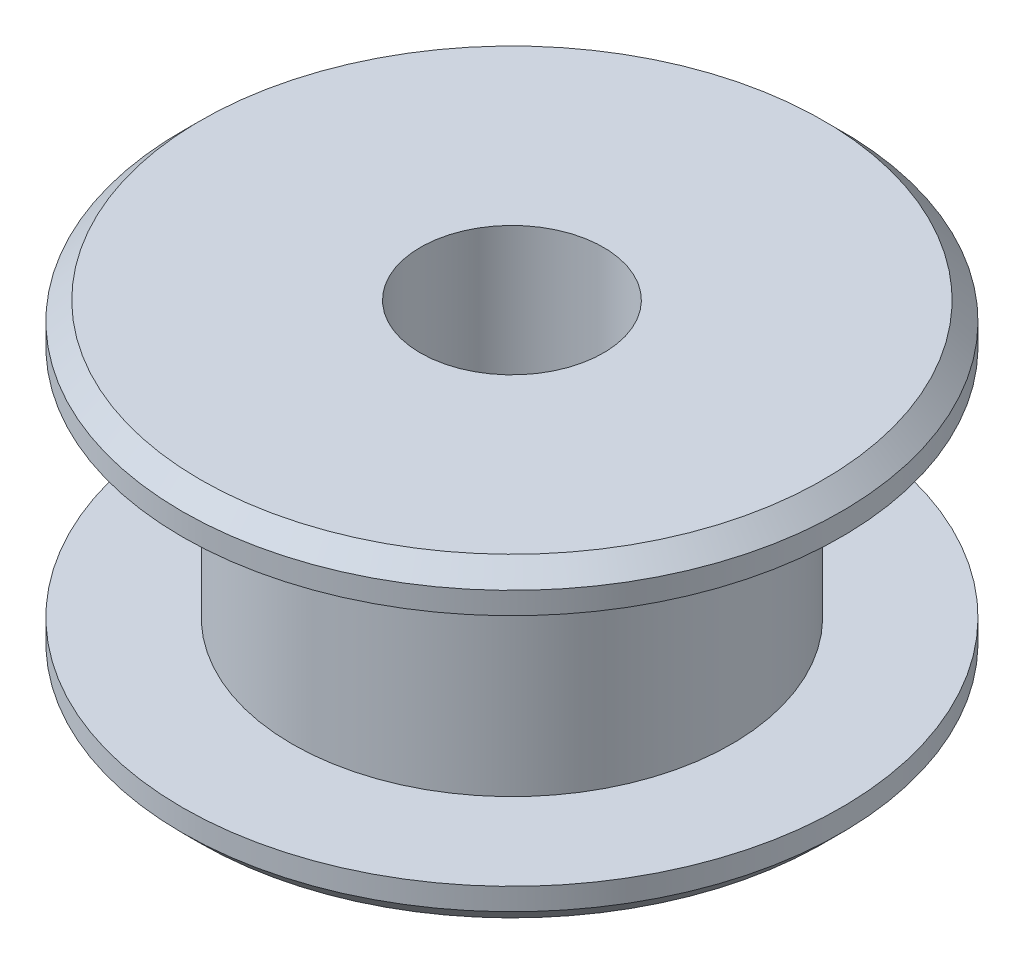
ISO-10303-21;
HEADER;
FILE_DESCRIPTION(('STEP AP214'),'2;1');
FILE_NAME('part.step','',(''),(''),'','','');
FILE_SCHEMA(('AUTOMOTIVE_DESIGN { 1 0 10303 214 1 1 1 1 }'));
ENDSEC;
DATA;
#1=APPLICATION_CONTEXT('core data for automotive mechanical design processes');
#2=APPLICATION_PROTOCOL_DEFINITION('international standard','automotive_design',2000,#1);
#3=PRODUCT_CONTEXT('',#1,'mechanical');
#4=PRODUCT('Part','Part','',(#3));
#5=PRODUCT_RELATED_PRODUCT_CATEGORY('part','',(#4));
#6=PRODUCT_DEFINITION_FORMATION('','',#4);
#7=PRODUCT_DEFINITION_CONTEXT('part definition',#1,'design');
#8=PRODUCT_DEFINITION('design','',#6,#7);
#9=PRODUCT_DEFINITION_SHAPE('','',#8);
#10=(LENGTH_UNIT() NAMED_UNIT(*) SI_UNIT(.MILLI.,.METRE.));
#11=(NAMED_UNIT(*) PLANE_ANGLE_UNIT() SI_UNIT($,.RADIAN.));
#12=(NAMED_UNIT(*) SI_UNIT($,.STERADIAN.) SOLID_ANGLE_UNIT());
#13=UNCERTAINTY_MEASURE_WITH_UNIT(LENGTH_MEASURE(1.E-05),#10,'distance_accuracy_value','');
#14=(GEOMETRIC_REPRESENTATION_CONTEXT(3) GLOBAL_UNCERTAINTY_ASSIGNED_CONTEXT((#13)) GLOBAL_UNIT_ASSIGNED_CONTEXT((#10,
#11,#12)) REPRESENTATION_CONTEXT('',''));
#15=CARTESIAN_POINT('',(0.,0.,0.));
#16=DIRECTION('',(0.,0.,1.));
#17=DIRECTION('',(1.,0.,0.));
#18=AXIS2_PLACEMENT_3D('',#15,#16,#17);
#19=CARTESIAN_POINT('',(0.,1.1,0.));
#20=DIRECTION('',(0.,-1.,0.));
#21=DIRECTION('',(0.,0.,-1.));
#22=AXIS2_PLACEMENT_3D('',#19,#20,#21);
#23=CYLINDRICAL_SURFACE('',#22,9.);
#24=CARTESIAN_POINT('',(0.,0.500000000000004,0.));
#25=DIRECTION('',(0.,1.,0.));
#26=DIRECTION('',(0.,0.,1.));
#27=AXIS2_PLACEMENT_3D('',#24,#25,#26);
#28=CIRCLE('',#27,9.);
#29=CARTESIAN_POINT('',(0.,0.500000000000004,9.));
#30=VERTEX_POINT('',#29);
#31=EDGE_CURVE('E49',#30,#30,#28,.T.);
#32=ORIENTED_EDGE('',*,*,#31,.T.);
#33=EDGE_LOOP('',(#32));
#34=FACE_BOUND('',#33,.T.);
#35=CARTESIAN_POINT('',(0.,1.1,0.));
#36=DIRECTION('',(0.,1.,0.));
#37=DIRECTION('',(0.,0.,1.));
#38=AXIS2_PLACEMENT_3D('',#35,#36,#37);
#39=CIRCLE('',#38,9.);
#40=CARTESIAN_POINT('',(0.,1.1,9.));
#41=VERTEX_POINT('',#40);
#42=EDGE_CURVE('E54',#41,#41,#39,.T.);
#43=ORIENTED_EDGE('',*,*,#42,.F.);
#44=EDGE_LOOP('',(#43));
#45=FACE_BOUND('',#44,.T.);
#46=ADVANCED_FACE('F34',(#34,#45),#23,.T.);
#47=CARTESIAN_POINT('',(0.,1.1,0.));
#48=DIRECTION('',(0.,1.,0.));
#49=DIRECTION('',(0.,0.,1.));
#50=AXIS2_PLACEMENT_3D('',#47,#48,#49);
#51=PLANE('',#50);
#52=CARTESIAN_POINT('',(0.,1.1,0.));
#53=DIRECTION('',(0.,1.,0.));
#54=DIRECTION('',(0.,0.,1.));
#55=AXIS2_PLACEMENT_3D('',#52,#53,#54);
#56=CIRCLE('',#55,6.);
#57=CARTESIAN_POINT('',(0.,1.1,6.));
#58=VERTEX_POINT('',#57);
#59=EDGE_CURVE('E58',#58,#58,#56,.T.);
#60=ORIENTED_EDGE('',*,*,#59,.F.);
#61=EDGE_LOOP('',(#60));
#62=FACE_BOUND('',#61,.T.);
#63=ORIENTED_EDGE('',*,*,#42,.T.);
#64=EDGE_LOOP('',(#63));
#65=FACE_BOUND('',#64,.T.);
#66=ADVANCED_FACE('F97',(#62,#65),#51,.T.);
#67=CARTESIAN_POINT('',(0.,0.,0.));
#68=DIRECTION('',(0.,1.,0.));
#69=DIRECTION('',(0.,0.,1.));
#70=AXIS2_PLACEMENT_3D('',#67,#68,#69);
#71=PLANE('',#70);
#72=CARTESIAN_POINT('',(0.,0.,0.));
#73=DIRECTION('',(0.,1.,0.));
#74=DIRECTION('',(0.,0.,1.));
#75=AXIS2_PLACEMENT_3D('',#72,#73,#74);
#76=CIRCLE('',#75,2.5);
#77=CARTESIAN_POINT('',(0.,0.,2.5));
#78=VERTEX_POINT('',#77);
#79=EDGE_CURVE('E66',#78,#78,#76,.T.);
#80=ORIENTED_EDGE('',*,*,#79,.T.);
#81=EDGE_LOOP('',(#80));
#82=FACE_BOUND('',#81,.T.);
#83=CARTESIAN_POINT('',(0.,0.,0.));
#84=DIRECTION('',(0.,1.,0.));
#85=DIRECTION('',(0.,0.,1.));
#86=AXIS2_PLACEMENT_3D('',#83,#84,#85);
#87=CIRCLE('',#86,8.49999999999999);
#88=CARTESIAN_POINT('',(0.,0.,8.49999999999999));
#89=VERTEX_POINT('',#88);
#90=EDGE_CURVE('E45',#89,#89,#87,.F.);
#91=ORIENTED_EDGE('',*,*,#90,.T.);
#92=EDGE_LOOP('',(#91));
#93=FACE_BOUND('',#92,.T.);
#94=ADVANCED_FACE('F73',(#82,#93),#71,.F.);
#95=CARTESIAN_POINT('',(0.,7.5,0.));
#96=DIRECTION('',(0.,-1.,0.));
#97=DIRECTION('',(0.,0.,-1.));
#98=AXIS2_PLACEMENT_3D('',#95,#96,#97);
#99=CYLINDRICAL_SURFACE('',#98,6.);
#100=CARTESIAN_POINT('',(0.,7.5,0.));
#101=DIRECTION('',(0.,1.,0.));
#102=DIRECTION('',(0.,0.,1.));
#103=AXIS2_PLACEMENT_3D('',#100,#101,#102);
#104=CIRCLE('',#103,6.);
#105=CARTESIAN_POINT('',(0.,7.5,6.));
#106=VERTEX_POINT('',#105);
#107=EDGE_CURVE('E57',#106,#106,#104,.T.);
#108=ORIENTED_EDGE('',*,*,#107,.F.);
#109=EDGE_LOOP('',(#108));
#110=FACE_BOUND('',#109,.T.);
#111=ORIENTED_EDGE('',*,*,#59,.T.);
#112=EDGE_LOOP('',(#111));
#113=FACE_BOUND('',#112,.T.);
#114=ADVANCED_FACE('F94',(#110,#113),#99,.T.);
#115=CARTESIAN_POINT('',(0.,8.6,0.));
#116=DIRECTION('',(0.,-1.,0.));
#117=DIRECTION('',(0.,0.,-1.));
#118=AXIS2_PLACEMENT_3D('',#115,#116,#117);
#119=CYLINDRICAL_SURFACE('',#118,9.);
#120=CARTESIAN_POINT('',(0.,8.1,0.));
#121=DIRECTION('',(0.,1.,0.));
#122=DIRECTION('',(0.,0.,1.));
#123=AXIS2_PLACEMENT_3D('',#120,#121,#122);
#124=CIRCLE('',#123,9.);
#125=CARTESIAN_POINT('',(0.,8.1,9.));
#126=VERTEX_POINT('',#125);
#127=EDGE_CURVE('E10',#126,#126,#124,.F.);
#128=ORIENTED_EDGE('',*,*,#127,.T.);
#129=EDGE_LOOP('',(#128));
#130=FACE_BOUND('',#129,.T.);
#131=CARTESIAN_POINT('',(0.,7.5,0.));
#132=DIRECTION('',(0.,1.,0.));
#133=DIRECTION('',(0.,0.,1.));
#134=AXIS2_PLACEMENT_3D('',#131,#132,#133);
#135=CIRCLE('',#134,9.);
#136=CARTESIAN_POINT('',(0.,7.5,9.));
#137=VERTEX_POINT('',#136);
#138=EDGE_CURVE('E61',#137,#137,#135,.T.);
#139=ORIENTED_EDGE('',*,*,#138,.T.);
#140=EDGE_LOOP('',(#139));
#141=FACE_BOUND('',#140,.T.);
#142=ADVANCED_FACE('F85',(#130,#141),#119,.T.);
#143=CARTESIAN_POINT('',(0.,8.6,0.));
#144=DIRECTION('',(0.,1.,0.));
#145=DIRECTION('',(0.,0.,1.));
#146=AXIS2_PLACEMENT_3D('',#143,#144,#145);
#147=PLANE('',#146);
#148=CARTESIAN_POINT('',(0.,8.6,0.));
#149=DIRECTION('',(0.,1.,0.));
#150=DIRECTION('',(0.,0.,1.));
#151=AXIS2_PLACEMENT_3D('',#148,#149,#150);
#152=CIRCLE('',#151,2.5);
#153=CARTESIAN_POINT('',(0.,8.6,2.5));
#154=VERTEX_POINT('',#153);
#155=EDGE_CURVE('E67',#154,#154,#152,.T.);
#156=ORIENTED_EDGE('',*,*,#155,.F.);
#157=EDGE_LOOP('',(#156));
#158=FACE_BOUND('',#157,.T.);
#159=CARTESIAN_POINT('',(0.,8.6,0.));
#160=DIRECTION('',(0.,1.,0.));
#161=DIRECTION('',(0.,0.,1.));
#162=AXIS2_PLACEMENT_3D('',#159,#160,#161);
#163=CIRCLE('',#162,8.5);
#164=CARTESIAN_POINT('',(0.,8.6,8.5));
#165=VERTEX_POINT('',#164);
#166=EDGE_CURVE('E41',#165,#165,#163,.T.);
#167=ORIENTED_EDGE('',*,*,#166,.T.);
#168=EDGE_LOOP('',(#167));
#169=FACE_BOUND('',#168,.T.);
#170=ADVANCED_FACE('F82',(#158,#169),#147,.T.);
#171=CARTESIAN_POINT('',(0.,7.5,0.));
#172=DIRECTION('',(0.,1.,0.));
#173=DIRECTION('',(0.,0.,1.));
#174=AXIS2_PLACEMENT_3D('',#171,#172,#173);
#175=PLANE('',#174);
#176=ORIENTED_EDGE('',*,*,#107,.T.);
#177=EDGE_LOOP('',(#176));
#178=FACE_BOUND('',#177,.T.);
#179=ORIENTED_EDGE('',*,*,#138,.F.);
#180=EDGE_LOOP('',(#179));
#181=FACE_BOUND('',#180,.T.);
#182=ADVANCED_FACE('F84',(#178,#181),#175,.F.);
#183=CARTESIAN_POINT('',(0.,0.500000000000004,0.));
#184=DIRECTION('',(0.,1.,0.));
#185=DIRECTION('',(0.,0.,1.));
#186=AXIS2_PLACEMENT_3D('',#183,#184,#185);
#187=CONICAL_SURFACE('',#186,9.,0.78539816339745);
#188=ORIENTED_EDGE('',*,*,#90,.F.);
#189=EDGE_LOOP('',(#188));
#190=FACE_BOUND('',#189,.T.);
#191=ORIENTED_EDGE('',*,*,#31,.F.);
#192=EDGE_LOOP('',(#191));
#193=FACE_BOUND('',#192,.T.);
#194=ADVANCED_FACE('F91',(#190,#193),#187,.T.);
#195=CARTESIAN_POINT('',(0.,8.6,0.));
#196=DIRECTION('',(0.,-1.,0.));
#197=DIRECTION('',(0.,0.,-1.));
#198=AXIS2_PLACEMENT_3D('',#195,#196,#197);
#199=CONICAL_SURFACE('',#198,8.5,0.785398163397445);
#200=ORIENTED_EDGE('',*,*,#127,.F.);
#201=EDGE_LOOP('',(#200));
#202=FACE_BOUND('',#201,.T.);
#203=ORIENTED_EDGE('',*,*,#166,.F.);
#204=EDGE_LOOP('',(#203));
#205=FACE_BOUND('',#204,.T.);
#206=ADVANCED_FACE('F36',(#202,#205),#199,.T.);
#207=CARTESIAN_POINT('',(0.,0.,0.));
#208=DIRECTION('',(0.,1.,0.));
#209=DIRECTION('',(0.,0.,1.));
#210=AXIS2_PLACEMENT_3D('',#207,#208,#209);
#211=CYLINDRICAL_SURFACE('',#210,2.5);
#212=ORIENTED_EDGE('',*,*,#79,.F.);
#213=EDGE_LOOP('',(#212));
#214=FACE_BOUND('',#213,.T.);
#215=ORIENTED_EDGE('',*,*,#155,.T.);
#216=EDGE_LOOP('',(#215));
#217=FACE_BOUND('',#216,.T.);
#218=ADVANCED_FACE('F76',(#214,#217),#211,.F.);
#219=CLOSED_SHELL('',(#46,#66,#94,#114,#142,#170,#182,#194,#206,#218));
#220=MANIFOLD_SOLID_BREP('B2',#219);
#221=ADVANCED_BREP_SHAPE_REPRESENTATION('',(#18,#220),#14);
#222=SHAPE_DEFINITION_REPRESENTATION(#9,#221);
ENDSEC;
END-ISO-10303-21;
